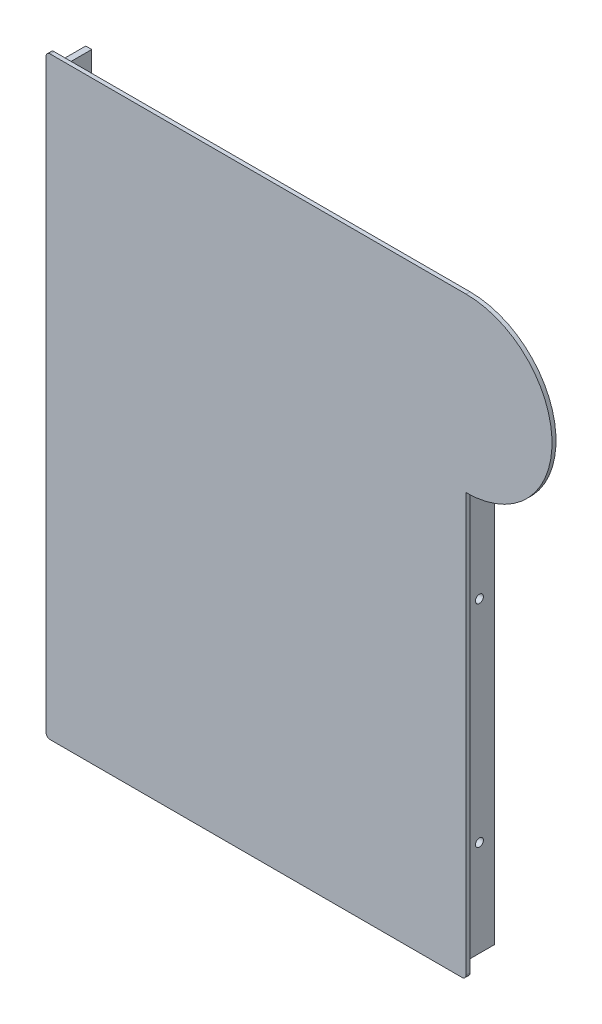
ISO-10303-21;
HEADER;
FILE_DESCRIPTION(('STEP AP214'),'2;1');
FILE_NAME('part.step','',(''),(''),'','','');
FILE_SCHEMA(('AUTOMOTIVE_DESIGN { 1 0 10303 214 1 1 1 1 }'));
ENDSEC;
DATA;
#1=APPLICATION_CONTEXT('core data for automotive mechanical design processes');
#2=APPLICATION_PROTOCOL_DEFINITION('international standard','automotive_design',2000,#1);
#3=PRODUCT_CONTEXT('',#1,'mechanical');
#4=PRODUCT('Part','Part','',(#3));
#5=PRODUCT_RELATED_PRODUCT_CATEGORY('part','',(#4));
#6=PRODUCT_DEFINITION_FORMATION('','',#4);
#7=PRODUCT_DEFINITION_CONTEXT('part definition',#1,'design');
#8=PRODUCT_DEFINITION('design','',#6,#7);
#9=PRODUCT_DEFINITION_SHAPE('','',#8);
#10=(LENGTH_UNIT() NAMED_UNIT(*) SI_UNIT(.MILLI.,.METRE.));
#11=(NAMED_UNIT(*) PLANE_ANGLE_UNIT() SI_UNIT($,.RADIAN.));
#12=(NAMED_UNIT(*) SI_UNIT($,.STERADIAN.) SOLID_ANGLE_UNIT());
#13=UNCERTAINTY_MEASURE_WITH_UNIT(LENGTH_MEASURE(1.E-05),#10,'distance_accuracy_value','');
#14=(GEOMETRIC_REPRESENTATION_CONTEXT(3) GLOBAL_UNCERTAINTY_ASSIGNED_CONTEXT((#13)) GLOBAL_UNIT_ASSIGNED_CONTEXT((#10,
#11,#12)) REPRESENTATION_CONTEXT('',''));
#15=CARTESIAN_POINT('',(0.,0.,0.));
#16=DIRECTION('',(0.,0.,1.));
#17=DIRECTION('',(1.,0.,0.));
#18=AXIS2_PLACEMENT_3D('',#15,#16,#17);
#19=CARTESIAN_POINT('',(0.,10.35,0.));
#20=DIRECTION('',(0.,0.,1.));
#21=DIRECTION('',(1.,0.,0.));
#22=AXIS2_PLACEMENT_3D('',#19,#20,#21);
#23=PLANE('',#22);
#24=CARTESIAN_POINT('',(0.,10.35,0.));
#25=DIRECTION('',(0.,0.,1.));
#26=DIRECTION('',(1.,0.,0.));
#27=AXIS2_PLACEMENT_3D('',#24,#25,#26);
#28=CIRCLE('',#27,43.);
#29=CARTESIAN_POINT('',(0.,-32.65,0.));
#30=VERTEX_POINT('',#29);
#31=CARTESIAN_POINT('',(0.,53.35,0.));
#32=VERTEX_POINT('',#31);
#33=EDGE_CURVE('E191',#30,#32,#28,.T.);
#34=ORIENTED_EDGE('',*,*,#33,.F.);
#35=DIRECTION('',(0.,1.,0.));
#36=VECTOR('',#35,1.);
#37=CARTESIAN_POINT('',(0.,-241.65,0.));
#38=LINE('',#37,#36);
#39=CARTESIAN_POINT('',(0.,-241.65,0.));
#40=VERTEX_POINT('',#39);
#41=EDGE_CURVE('E281',#40,#30,#38,.T.);
#42=ORIENTED_EDGE('',*,*,#41,.F.);
#43=CARTESIAN_POINT('',(-2.00000000000004,-241.65,0.));
#44=DIRECTION('',(0.,0.,1.));
#45=DIRECTION('',(1.,0.,0.));
#46=AXIS2_PLACEMENT_3D('',#43,#44,#45);
#47=CIRCLE('',#46,2.);
#48=CARTESIAN_POINT('',(-2.00000000000004,-243.65,0.));
#49=VERTEX_POINT('',#48);
#50=EDGE_CURVE('E308',#49,#40,#47,.T.);
#51=ORIENTED_EDGE('',*,*,#50,.F.);
#52=DIRECTION('',(1.,0.,0.));
#53=VECTOR('',#52,1.);
#54=CARTESIAN_POINT('',(-208.,-243.65,0.));
#55=LINE('',#54,#53);
#56=CARTESIAN_POINT('',(-208.,-243.65,0.));
#57=VERTEX_POINT('',#56);
#58=EDGE_CURVE('E306',#57,#49,#55,.T.);
#59=ORIENTED_EDGE('',*,*,#58,.F.);
#60=CARTESIAN_POINT('',(-208.,-241.65,0.));
#61=DIRECTION('',(0.,0.,1.));
#62=DIRECTION('',(1.,0.,0.));
#63=AXIS2_PLACEMENT_3D('',#60,#61,#62);
#64=CIRCLE('',#63,2.);
#65=CARTESIAN_POINT('',(-210.,-241.65,0.));
#66=VERTEX_POINT('',#65);
#67=EDGE_CURVE('E304',#66,#57,#64,.T.);
#68=ORIENTED_EDGE('',*,*,#67,.F.);
#69=DIRECTION('',(0.,-1.,0.));
#70=VECTOR('',#69,1.);
#71=CARTESIAN_POINT('',(-210.,51.35,0.));
#72=LINE('',#71,#70);
#73=CARTESIAN_POINT('',(-210.,51.35,0.));
#74=VERTEX_POINT('',#73);
#75=EDGE_CURVE('E302',#74,#66,#72,.T.);
#76=ORIENTED_EDGE('',*,*,#75,.F.);
#77=CARTESIAN_POINT('',(-208.,51.35,0.));
#78=DIRECTION('',(0.,0.,1.));
#79=DIRECTION('',(1.,0.,0.));
#80=AXIS2_PLACEMENT_3D('',#77,#78,#79);
#81=CIRCLE('',#80,2.);
#82=CARTESIAN_POINT('',(-208.,53.35,0.));
#83=VERTEX_POINT('',#82);
#84=EDGE_CURVE('E300',#83,#74,#81,.T.);
#85=ORIENTED_EDGE('',*,*,#84,.F.);
#86=DIRECTION('',(-1.,0.,0.));
#87=VECTOR('',#86,1.);
#88=CARTESIAN_POINT('',(0.,53.35,0.));
#89=LINE('',#88,#87);
#90=EDGE_CURVE('E298',#32,#83,#89,.T.);
#91=ORIENTED_EDGE('',*,*,#90,.F.);
#92=EDGE_LOOP('',(#34,#42,#51,#59,#68,#76,#85,#91));
#93=FACE_BOUND('',#92,.T.);
#94=DIRECTION('',(0.,1.,0.));
#95=VECTOR('',#94,1.);
#96=CARTESIAN_POINT('',(-5.80000000000004,-238.359531245036,0.));
#97=LINE('',#96,#95);
#98=CARTESIAN_POINT('',(-5.80000000000004,-236.986839537341,0.));
#99=VERTEX_POINT('',#98);
#100=CARTESIAN_POINT('',(-5.80000000000004,-37.127932811719,0.));
#101=VERTEX_POINT('',#100);
#102=EDGE_CURVE('E189',#99,#101,#97,.T.);
#103=ORIENTED_EDGE('',*,*,#102,.F.);
#104=DIRECTION('',(0.756701255018241,0.653760820678189,0.));
#105=VECTOR('',#104,1.);
#106=CARTESIAN_POINT('',(-7.64389759108179,-238.579896234945,0.));
#107=LINE('',#106,#105);
#108=CARTESIAN_POINT('',(-6.79907272616674,-237.85,0.));
#109=VERTEX_POINT('',#108);
#110=EDGE_CURVE('E184',#109,#99,#107,.T.);
#111=ORIENTED_EDGE('',*,*,#110,.F.);
#112=DIRECTION('',(1.,0.,0.));
#113=VECTOR('',#112,1.);
#114=CARTESIAN_POINT('',(-205.130446753057,-237.85,0.));
#115=LINE('',#114,#113);
#116=CARTESIAN_POINT('',(-203.757755045363,-237.85,0.));
#117=VERTEX_POINT('',#116);
#118=EDGE_CURVE('E243',#117,#109,#115,.T.);
#119=ORIENTED_EDGE('',*,*,#118,.F.);
#120=DIRECTION('',(0.65376082067819,-0.75670125501824,0.));
#121=VECTOR('',#120,1.);
#122=CARTESIAN_POINT('',(-204.929896234945,-236.493294793506,0.));
#123=LINE('',#122,#121);
#124=CARTESIAN_POINT('',(-204.2,-237.338119658421,0.));
#125=VERTEX_POINT('',#124);
#126=EDGE_CURVE('E240',#125,#117,#123,.T.);
#127=ORIENTED_EDGE('',*,*,#126,.F.);
#128=DIRECTION('',(0.,1.,0.));
#129=VECTOR('',#128,1.);
#130=CARTESIAN_POINT('',(-204.2,48.6876579472402,0.));
#131=LINE('',#130,#129);
#132=CARTESIAN_POINT('',(-204.2,48.6876579472402,0.));
#133=VERTEX_POINT('',#132);
#134=EDGE_CURVE('E237',#133,#125,#131,.F.);
#135=ORIENTED_EDGE('',*,*,#134,.F.);
#136=DIRECTION('',(-1.,0.,0.));
#137=VECTOR('',#136,1.);
#138=CARTESIAN_POINT('',(-204.2,48.6876579472402,0.));
#139=LINE('',#138,#137);
#140=CARTESIAN_POINT('',(-207.2,48.6876579472402,0.));
#141=VERTEX_POINT('',#140);
#142=EDGE_CURVE('E235',#133,#141,#139,.T.);
#143=ORIENTED_EDGE('',*,*,#142,.T.);
#144=DIRECTION('',(0.,-1.,0.));
#145=VECTOR('',#144,1.);
#146=CARTESIAN_POINT('',(-207.2,48.6876579472402,0.));
#147=LINE('',#146,#145);
#148=CARTESIAN_POINT('',(-207.2,-238.454577255541,0.));
#149=VERTEX_POINT('',#148);
#150=EDGE_CURVE('E233',#141,#149,#147,.T.);
#151=ORIENTED_EDGE('',*,*,#150,.T.);
#152=DIRECTION('',(0.65376082067819,-0.75670125501824,0.));
#153=VECTOR('',#152,1.);
#154=CARTESIAN_POINT('',(-207.2,-238.454577255541,0.));
#155=LINE('',#154,#153);
#156=CARTESIAN_POINT('',(-205.130446753057,-240.85,0.));
#157=VERTEX_POINT('',#156);
#158=EDGE_CURVE('E231',#149,#157,#155,.T.);
#159=ORIENTED_EDGE('',*,*,#158,.T.);
#160=DIRECTION('',(1.,0.,0.));
#161=VECTOR('',#160,1.);
#162=CARTESIAN_POINT('',(-205.130446753057,-240.85,0.));
#163=LINE('',#162,#161);
#164=CARTESIAN_POINT('',(-5.68261512904722,-240.85,0.));
#165=VERTEX_POINT('',#164);
#166=EDGE_CURVE('E229',#157,#165,#163,.T.);
#167=ORIENTED_EDGE('',*,*,#166,.T.);
#168=DIRECTION('',(0.756701255018241,0.653760820678189,0.));
#169=VECTOR('',#168,1.);
#170=CARTESIAN_POINT('',(-5.68261512904722,-240.85,0.));
#171=LINE('',#170,#169);
#172=CARTESIAN_POINT('',(-2.80000000000004,-238.359531245036,0.));
#173=VERTEX_POINT('',#172);
#174=EDGE_CURVE('E227',#165,#173,#171,.T.);
#175=ORIENTED_EDGE('',*,*,#174,.T.);
#176=DIRECTION('',(0.,1.,0.));
#177=VECTOR('',#176,1.);
#178=CARTESIAN_POINT('',(-2.80000000000004,-238.359531245036,0.));
#179=LINE('',#178,#177);
#180=CARTESIAN_POINT('',(-2.80000000000004,-37.127932811719,0.));
#181=VERTEX_POINT('',#180);
#182=EDGE_CURVE('E56',#173,#181,#179,.T.);
#183=ORIENTED_EDGE('',*,*,#182,.T.);
#184=DIRECTION('',(-1.,0.,0.));
#185=VECTOR('',#184,1.);
#186=CARTESIAN_POINT('',(-2.80000000000004,-37.127932811719,0.));
#187=LINE('',#186,#185);
#188=EDGE_CURVE('E51',#181,#101,#187,.T.);
#189=ORIENTED_EDGE('',*,*,#188,.T.);
#190=EDGE_LOOP('',(#103,#111,#119,#127,#135,#143,#151,#159,#167,#175,#183,#189));
#191=FACE_BOUND('',#190,.T.);
#192=ADVANCED_FACE('F34',(#93,#191),#23,.F.);
#193=CARTESIAN_POINT('',(0.,10.35,2.));
#194=DIRECTION('',(0.,0.,-1.));
#195=DIRECTION('',(-1.,0.,0.));
#196=AXIS2_PLACEMENT_3D('',#193,#194,#195);
#197=CYLINDRICAL_SURFACE('',#196,43.);
#198=ORIENTED_EDGE('',*,*,#33,.T.);
#199=DIRECTION('',(0.,0.,-1.));
#200=VECTOR('',#199,1.);
#201=CARTESIAN_POINT('',(0.,53.35,2.));
#202=LINE('',#201,#200);
#203=CARTESIAN_POINT('',(0.,53.35,2.));
#204=VERTEX_POINT('',#203);
#205=EDGE_CURVE('E11',#204,#32,#202,.T.);
#206=ORIENTED_EDGE('',*,*,#205,.F.);
#207=CARTESIAN_POINT('',(0.,10.35,2.));
#208=DIRECTION('',(0.,0.,1.));
#209=DIRECTION('',(1.,0.,0.));
#210=AXIS2_PLACEMENT_3D('',#207,#208,#209);
#211=CIRCLE('',#210,43.);
#212=CARTESIAN_POINT('',(0.,-32.65,2.));
#213=VERTEX_POINT('',#212);
#214=EDGE_CURVE('E277',#213,#204,#211,.T.);
#215=ORIENTED_EDGE('',*,*,#214,.F.);
#216=DIRECTION('',(0.,0.,-1.));
#217=VECTOR('',#216,1.);
#218=CARTESIAN_POINT('',(0.,-32.65,2.));
#219=LINE('',#218,#217);
#220=EDGE_CURVE('E295',#213,#30,#219,.T.);
#221=ORIENTED_EDGE('',*,*,#220,.T.);
#222=EDGE_LOOP('',(#198,#206,#215,#221));
#223=FACE_BOUND('',#222,.T.);
#224=ADVANCED_FACE('F36',(#223),#197,.T.);
#225=CARTESIAN_POINT('',(0.,53.35,2.));
#226=DIRECTION('',(0.,-1.,0.));
#227=DIRECTION('',(0.,0.,-1.));
#228=AXIS2_PLACEMENT_3D('',#225,#226,#227);
#229=PLANE('',#228);
#230=ORIENTED_EDGE('',*,*,#90,.T.);
#231=DIRECTION('',(0.,0.,-1.));
#232=VECTOR('',#231,1.);
#233=CARTESIAN_POINT('',(-208.,53.35,2.));
#234=LINE('',#233,#232);
#235=CARTESIAN_POINT('',(-208.,53.35,2.));
#236=VERTEX_POINT('',#235);
#237=EDGE_CURVE('E43',#236,#83,#234,.T.);
#238=ORIENTED_EDGE('',*,*,#237,.F.);
#239=DIRECTION('',(-1.,0.,0.));
#240=VECTOR('',#239,1.);
#241=CARTESIAN_POINT('',(0.,53.35,2.));
#242=LINE('',#241,#240);
#243=EDGE_CURVE('E280',#204,#236,#242,.T.);
#244=ORIENTED_EDGE('',*,*,#243,.F.);
#245=ORIENTED_EDGE('',*,*,#205,.T.);
#246=EDGE_LOOP('',(#230,#238,#244,#245));
#247=FACE_BOUND('',#246,.T.);
#248=ADVANCED_FACE('F415',(#247),#229,.F.);
#249=CARTESIAN_POINT('',(-208.,51.35,2.));
#250=DIRECTION('',(0.,0.,-1.));
#251=DIRECTION('',(-1.,0.,0.));
#252=AXIS2_PLACEMENT_3D('',#249,#250,#251);
#253=CYLINDRICAL_SURFACE('',#252,2.);
#254=ORIENTED_EDGE('',*,*,#84,.T.);
#255=DIRECTION('',(0.,0.,-1.));
#256=VECTOR('',#255,1.);
#257=CARTESIAN_POINT('',(-210.,51.35,2.));
#258=LINE('',#257,#256);
#259=CARTESIAN_POINT('',(-210.,51.35,2.));
#260=VERTEX_POINT('',#259);
#261=EDGE_CURVE('E325',#260,#74,#258,.T.);
#262=ORIENTED_EDGE('',*,*,#261,.F.);
#263=CARTESIAN_POINT('',(-208.,51.35,2.));
#264=DIRECTION('',(0.,0.,1.));
#265=DIRECTION('',(1.,0.,0.));
#266=AXIS2_PLACEMENT_3D('',#263,#264,#265);
#267=CIRCLE('',#266,2.);
#268=EDGE_CURVE('E283',#236,#260,#267,.T.);
#269=ORIENTED_EDGE('',*,*,#268,.F.);
#270=ORIENTED_EDGE('',*,*,#237,.T.);
#271=EDGE_LOOP('',(#254,#262,#269,#270));
#272=FACE_BOUND('',#271,.T.);
#273=ADVANCED_FACE('F441',(#272),#253,.T.);
#274=CARTESIAN_POINT('',(-210.,51.35,2.));
#275=DIRECTION('',(1.,0.,0.));
#276=DIRECTION('',(0.,1.,0.));
#277=AXIS2_PLACEMENT_3D('',#274,#275,#276);
#278=PLANE('',#277);
#279=ORIENTED_EDGE('',*,*,#75,.T.);
#280=DIRECTION('',(0.,0.,-1.));
#281=VECTOR('',#280,1.);
#282=CARTESIAN_POINT('',(-210.,-241.65,2.));
#283=LINE('',#282,#281);
#284=CARTESIAN_POINT('',(-210.,-241.65,2.));
#285=VERTEX_POINT('',#284);
#286=EDGE_CURVE('E322',#285,#66,#283,.T.);
#287=ORIENTED_EDGE('',*,*,#286,.F.);
#288=DIRECTION('',(0.,-1.,0.));
#289=VECTOR('',#288,1.);
#290=CARTESIAN_POINT('',(-210.,51.35,2.));
#291=LINE('',#290,#289);
#292=EDGE_CURVE('E285',#260,#285,#291,.T.);
#293=ORIENTED_EDGE('',*,*,#292,.F.);
#294=ORIENTED_EDGE('',*,*,#261,.T.);
#295=EDGE_LOOP('',(#279,#287,#293,#294));
#296=FACE_BOUND('',#295,.T.);
#297=ADVANCED_FACE('F437',(#296),#278,.F.);
#298=CARTESIAN_POINT('',(-208.,-241.65,2.));
#299=DIRECTION('',(0.,0.,-1.));
#300=DIRECTION('',(-1.,0.,0.));
#301=AXIS2_PLACEMENT_3D('',#298,#299,#300);
#302=CYLINDRICAL_SURFACE('',#301,2.);
#303=ORIENTED_EDGE('',*,*,#67,.T.);
#304=DIRECTION('',(0.,0.,-1.));
#305=VECTOR('',#304,1.);
#306=CARTESIAN_POINT('',(-208.,-243.65,2.));
#307=LINE('',#306,#305);
#308=CARTESIAN_POINT('',(-208.,-243.65,2.));
#309=VERTEX_POINT('',#308);
#310=EDGE_CURVE('E319',#309,#57,#307,.T.);
#311=ORIENTED_EDGE('',*,*,#310,.F.);
#312=CARTESIAN_POINT('',(-208.,-241.65,2.));
#313=DIRECTION('',(0.,0.,1.));
#314=DIRECTION('',(1.,0.,0.));
#315=AXIS2_PLACEMENT_3D('',#312,#313,#314);
#316=CIRCLE('',#315,2.);
#317=EDGE_CURVE('E287',#285,#309,#316,.T.);
#318=ORIENTED_EDGE('',*,*,#317,.F.);
#319=ORIENTED_EDGE('',*,*,#286,.T.);
#320=EDGE_LOOP('',(#303,#311,#318,#319));
#321=FACE_BOUND('',#320,.T.);
#322=ADVANCED_FACE('F433',(#321),#302,.T.);
#323=CARTESIAN_POINT('',(-208.,-243.65,2.));
#324=DIRECTION('',(0.,1.,0.));
#325=DIRECTION('',(0.,0.,1.));
#326=AXIS2_PLACEMENT_3D('',#323,#324,#325);
#327=PLANE('',#326);
#328=ORIENTED_EDGE('',*,*,#58,.T.);
#329=DIRECTION('',(0.,0.,-1.));
#330=VECTOR('',#329,1.);
#331=CARTESIAN_POINT('',(-2.00000000000004,-243.65,2.));
#332=LINE('',#331,#330);
#333=CARTESIAN_POINT('',(-2.00000000000004,-243.65,2.));
#334=VERTEX_POINT('',#333);
#335=EDGE_CURVE('E316',#334,#49,#332,.T.);
#336=ORIENTED_EDGE('',*,*,#335,.F.);
#337=DIRECTION('',(1.,0.,0.));
#338=VECTOR('',#337,1.);
#339=CARTESIAN_POINT('',(-208.,-243.65,2.));
#340=LINE('',#339,#338);
#341=EDGE_CURVE('E289',#309,#334,#340,.T.);
#342=ORIENTED_EDGE('',*,*,#341,.F.);
#343=ORIENTED_EDGE('',*,*,#310,.T.);
#344=EDGE_LOOP('',(#328,#336,#342,#343));
#345=FACE_BOUND('',#344,.T.);
#346=ADVANCED_FACE('F429',(#345),#327,.F.);
#347=CARTESIAN_POINT('',(-2.00000000000004,-241.65,2.));
#348=DIRECTION('',(0.,0.,-1.));
#349=DIRECTION('',(-1.,0.,0.));
#350=AXIS2_PLACEMENT_3D('',#347,#348,#349);
#351=CYLINDRICAL_SURFACE('',#350,2.);
#352=ORIENTED_EDGE('',*,*,#50,.T.);
#353=DIRECTION('',(0.,0.,-1.));
#354=VECTOR('',#353,1.);
#355=CARTESIAN_POINT('',(0.,-241.65,2.));
#356=LINE('',#355,#354);
#357=CARTESIAN_POINT('',(0.,-241.65,2.));
#358=VERTEX_POINT('',#357);
#359=EDGE_CURVE('E313',#358,#40,#356,.T.);
#360=ORIENTED_EDGE('',*,*,#359,.F.);
#361=CARTESIAN_POINT('',(-2.00000000000004,-241.65,2.));
#362=DIRECTION('',(0.,0.,1.));
#363=DIRECTION('',(1.,0.,0.));
#364=AXIS2_PLACEMENT_3D('',#361,#362,#363);
#365=CIRCLE('',#364,2.);
#366=EDGE_CURVE('E291',#334,#358,#365,.T.);
#367=ORIENTED_EDGE('',*,*,#366,.F.);
#368=ORIENTED_EDGE('',*,*,#335,.T.);
#369=EDGE_LOOP('',(#352,#360,#367,#368));
#370=FACE_BOUND('',#369,.T.);
#371=ADVANCED_FACE('F425',(#370),#351,.T.);
#372=CARTESIAN_POINT('',(0.,-241.65,2.));
#373=DIRECTION('',(-1.,0.,0.));
#374=DIRECTION('',(0.,-1.,0.));
#375=AXIS2_PLACEMENT_3D('',#372,#373,#374);
#376=PLANE('',#375);
#377=ORIENTED_EDGE('',*,*,#41,.T.);
#378=ORIENTED_EDGE('',*,*,#220,.F.);
#379=DIRECTION('',(0.,1.,0.));
#380=VECTOR('',#379,1.);
#381=CARTESIAN_POINT('',(0.,-241.65,2.));
#382=LINE('',#381,#380);
#383=EDGE_CURVE('E293',#358,#213,#382,.T.);
#384=ORIENTED_EDGE('',*,*,#383,.F.);
#385=ORIENTED_EDGE('',*,*,#359,.T.);
#386=EDGE_LOOP('',(#377,#378,#384,#385));
#387=FACE_BOUND('',#386,.T.);
#388=ADVANCED_FACE('F422',(#387),#376,.F.);
#389=CARTESIAN_POINT('',(0.,10.35,2.));
#390=DIRECTION('',(0.,0.,1.));
#391=DIRECTION('',(1.,0.,0.));
#392=AXIS2_PLACEMENT_3D('',#389,#390,#391);
#393=PLANE('',#392);
#394=ORIENTED_EDGE('',*,*,#214,.T.);
#395=ORIENTED_EDGE('',*,*,#243,.T.);
#396=ORIENTED_EDGE('',*,*,#268,.T.);
#397=ORIENTED_EDGE('',*,*,#292,.T.);
#398=ORIENTED_EDGE('',*,*,#317,.T.);
#399=ORIENTED_EDGE('',*,*,#341,.T.);
#400=ORIENTED_EDGE('',*,*,#366,.T.);
#401=ORIENTED_EDGE('',*,*,#383,.T.);
#402=EDGE_LOOP('',(#394,#395,#396,#397,#398,#399,#400,#401));
#403=FACE_BOUND('',#402,.T.);
#404=ADVANCED_FACE('F420',(#403),#393,.T.);
#405=CARTESIAN_POINT('',(-5.80000000000004,-238.359531245036,-15.));
#406=DIRECTION('',(1.,0.,0.));
#407=DIRECTION('',(0.,0.,-1.));
#408=AXIS2_PLACEMENT_3D('',#405,#406,#407);
#409=PLANE('',#408);
#410=CARTESIAN_POINT('',(-5.80000000000004,-84.8010569567936,-7.5));
#411=DIRECTION('',(1.,0.,0.));
#412=DIRECTION('',(0.,0.,-1.));
#413=AXIS2_PLACEMENT_3D('',#410,#411,#412);
#414=CIRCLE('',#413,2.00000000000001);
#415=CARTESIAN_POINT('',(-5.80000000000004,-84.8010569567936,-9.50000000000001));
#416=VERTEX_POINT('',#415);
#417=EDGE_CURVE('E346',#416,#416,#414,.T.);
#418=ORIENTED_EDGE('',*,*,#417,.T.);
#419=EDGE_LOOP('',(#418));
#420=FACE_BOUND('',#419,.T.);
#421=CARTESIAN_POINT('',(-5.80000000000004,-190.350496004111,-7.5));
#422=DIRECTION('',(1.,0.,0.));
#423=DIRECTION('',(0.,0.,-1.));
#424=AXIS2_PLACEMENT_3D('',#421,#422,#423);
#425=CIRCLE('',#424,2.00000000000001);
#426=CARTESIAN_POINT('',(-5.80000000000004,-190.350496004111,-9.50000000000001));
#427=VERTEX_POINT('',#426);
#428=EDGE_CURVE('E343',#427,#427,#425,.T.);
#429=ORIENTED_EDGE('',*,*,#428,.T.);
#430=EDGE_LOOP('',(#429));
#431=FACE_BOUND('',#430,.T.);
#432=ORIENTED_EDGE('',*,*,#102,.T.);
#433=DIRECTION('',(0.,0.,1.));
#434=VECTOR('',#433,1.);
#435=CARTESIAN_POINT('',(-5.80000000000004,-37.127932811719,-15.));
#436=LINE('',#435,#434);
#437=CARTESIAN_POINT('',(-5.80000000000004,-37.127932811719,-15.));
#438=VERTEX_POINT('',#437);
#439=EDGE_CURVE('E187',#438,#101,#436,.T.);
#440=ORIENTED_EDGE('',*,*,#439,.F.);
#441=DIRECTION('',(0.,1.,0.));
#442=VECTOR('',#441,1.);
#443=CARTESIAN_POINT('',(-5.80000000000004,-238.359531245036,-15.));
#444=LINE('',#443,#442);
#445=CARTESIAN_POINT('',(-5.80000000000004,-236.986839537341,-15.));
#446=VERTEX_POINT('',#445);
#447=EDGE_CURVE('E172',#446,#438,#444,.T.);
#448=ORIENTED_EDGE('',*,*,#447,.F.);
#449=DIRECTION('',(0.,0.,1.));
#450=VECTOR('',#449,1.);
#451=CARTESIAN_POINT('',(-5.80000000000004,-236.986839537341,-15.));
#452=LINE('',#451,#450);
#453=EDGE_CURVE('E222',#446,#99,#452,.T.);
#454=ORIENTED_EDGE('',*,*,#453,.T.);
#455=EDGE_LOOP('',(#432,#440,#448,#454));
#456=FACE_BOUND('',#455,.T.);
#457=ADVANCED_FACE('F188',(#420,#431,#456),#409,.F.);
#458=CARTESIAN_POINT('',(-2.80000000000004,-37.127932811719,-15.));
#459=DIRECTION('',(0.,1.,0.));
#460=DIRECTION('',(-1.,0.,0.));
#461=AXIS2_PLACEMENT_3D('',#458,#459,#460);
#462=PLANE('',#461);
#463=ORIENTED_EDGE('',*,*,#188,.F.);
#464=DIRECTION('',(0.,0.,1.));
#465=VECTOR('',#464,1.);
#466=CARTESIAN_POINT('',(-2.80000000000004,-37.127932811719,-15.));
#467=LINE('',#466,#465);
#468=CARTESIAN_POINT('',(-2.80000000000004,-37.127932811719,-15.));
#469=VERTEX_POINT('',#468);
#470=EDGE_CURVE('E192',#469,#181,#467,.T.);
#471=ORIENTED_EDGE('',*,*,#470,.F.);
#472=DIRECTION('',(-1.,0.,0.));
#473=VECTOR('',#472,1.);
#474=CARTESIAN_POINT('',(-2.80000000000004,-37.127932811719,-15.));
#475=LINE('',#474,#473);
#476=EDGE_CURVE('E177',#469,#438,#475,.T.);
#477=ORIENTED_EDGE('',*,*,#476,.T.);
#478=ORIENTED_EDGE('',*,*,#439,.T.);
#479=EDGE_LOOP('',(#463,#471,#477,#478));
#480=FACE_BOUND('',#479,.T.);
#481=ADVANCED_FACE('F194',(#480),#462,.T.);
#482=CARTESIAN_POINT('',(-2.80000000000004,-238.359531245036,-15.));
#483=DIRECTION('',(1.,0.,0.));
#484=DIRECTION('',(0.,0.,-1.));
#485=AXIS2_PLACEMENT_3D('',#482,#483,#484);
#486=PLANE('',#485);
#487=CARTESIAN_POINT('',(-2.80000000000004,-84.8010569567936,-7.5));
#488=DIRECTION('',(1.,0.,0.));
#489=DIRECTION('',(0.,0.,-1.));
#490=AXIS2_PLACEMENT_3D('',#487,#488,#489);
#491=CIRCLE('',#490,2.00000000000001);
#492=CARTESIAN_POINT('',(-2.80000000000004,-84.8010569567936,-9.50000000000001));
#493=VERTEX_POINT('',#492);
#494=EDGE_CURVE('E351',#493,#493,#491,.T.);
#495=ORIENTED_EDGE('',*,*,#494,.F.);
#496=EDGE_LOOP('',(#495));
#497=FACE_BOUND('',#496,.T.);
#498=CARTESIAN_POINT('',(-2.80000000000004,-190.350496004111,-7.5));
#499=DIRECTION('',(1.,0.,0.));
#500=DIRECTION('',(0.,0.,-1.));
#501=AXIS2_PLACEMENT_3D('',#498,#499,#500);
#502=CIRCLE('',#501,2.00000000000001);
#503=CARTESIAN_POINT('',(-2.80000000000004,-190.350496004111,-9.50000000000001));
#504=VERTEX_POINT('',#503);
#505=EDGE_CURVE('E338',#504,#504,#502,.T.);
#506=ORIENTED_EDGE('',*,*,#505,.F.);
#507=EDGE_LOOP('',(#506));
#508=FACE_BOUND('',#507,.T.);
#509=ORIENTED_EDGE('',*,*,#182,.F.);
#510=DIRECTION('',(0.,0.,1.));
#511=VECTOR('',#510,1.);
#512=CARTESIAN_POINT('',(-2.80000000000004,-238.359531245036,-15.));
#513=LINE('',#512,#511);
#514=CARTESIAN_POINT('',(-2.80000000000004,-238.359531245036,-15.));
#515=VERTEX_POINT('',#514);
#516=EDGE_CURVE('E273',#515,#173,#513,.T.);
#517=ORIENTED_EDGE('',*,*,#516,.F.);
#518=DIRECTION('',(0.,1.,0.));
#519=VECTOR('',#518,1.);
#520=CARTESIAN_POINT('',(-2.80000000000004,-238.359531245036,-15.));
#521=LINE('',#520,#519);
#522=EDGE_CURVE('E195',#515,#469,#521,.T.);
#523=ORIENTED_EDGE('',*,*,#522,.T.);
#524=ORIENTED_EDGE('',*,*,#470,.T.);
#525=EDGE_LOOP('',(#509,#517,#523,#524));
#526=FACE_BOUND('',#525,.T.);
#527=ADVANCED_FACE('F479',(#497,#508,#526),#486,.T.);
#528=CARTESIAN_POINT('',(-5.68261512904722,-240.85,-15.));
#529=DIRECTION('',(0.653760820678189,-0.756701255018241,0.));
#530=DIRECTION('',(0.756701255018241,0.653760820678189,0.));
#531=AXIS2_PLACEMENT_3D('',#528,#529,#530);
#532=PLANE('',#531);
#533=ORIENTED_EDGE('',*,*,#174,.F.);
#534=DIRECTION('',(0.,0.,1.));
#535=VECTOR('',#534,1.);
#536=CARTESIAN_POINT('',(-5.68261512904722,-240.85,-15.));
#537=LINE('',#536,#535);
#538=CARTESIAN_POINT('',(-5.68261512904722,-240.85,-15.));
#539=VERTEX_POINT('',#538);
#540=EDGE_CURVE('E270',#539,#165,#537,.T.);
#541=ORIENTED_EDGE('',*,*,#540,.F.);
#542=DIRECTION('',(0.756701255018241,0.653760820678189,0.));
#543=VECTOR('',#542,1.);
#544=CARTESIAN_POINT('',(-5.68261512904722,-240.85,-15.));
#545=LINE('',#544,#543);
#546=EDGE_CURVE('E197',#539,#515,#545,.T.);
#547=ORIENTED_EDGE('',*,*,#546,.T.);
#548=ORIENTED_EDGE('',*,*,#516,.T.);
#549=EDGE_LOOP('',(#533,#541,#547,#548));
#550=FACE_BOUND('',#549,.T.);
#551=ADVANCED_FACE('F368',(#550),#532,.T.);
#552=CARTESIAN_POINT('',(-205.130446753057,-240.85,-15.));
#553=DIRECTION('',(0.,-1.,0.));
#554=DIRECTION('',(1.,0.,0.));
#555=AXIS2_PLACEMENT_3D('',#552,#553,#554);
#556=PLANE('',#555);
#557=CARTESIAN_POINT('',(-42.1921113491282,-240.85,-7.5));
#558=DIRECTION('',(0.,-1.,0.));
#559=DIRECTION('',(-1.,0.,0.));
#560=AXIS2_PLACEMENT_3D('',#557,#558,#559);
#561=CIRCLE('',#560,2.);
#562=CARTESIAN_POINT('',(-44.1921113491282,-240.85,-7.5));
#563=VERTEX_POINT('',#562);
#564=EDGE_CURVE('E335',#563,#563,#561,.T.);
#565=ORIENTED_EDGE('',*,*,#564,.F.);
#566=EDGE_LOOP('',(#565));
#567=FACE_BOUND('',#566,.T.);
#568=CARTESIAN_POINT('',(-167.807888650872,-240.85,-7.5));
#569=DIRECTION('',(0.,-1.,0.));
#570=DIRECTION('',(1.,0.,0.));
#571=AXIS2_PLACEMENT_3D('',#568,#569,#570);
#572=CIRCLE('',#571,2.);
#573=CARTESIAN_POINT('',(-165.807888650872,-240.85,-7.5));
#574=VERTEX_POINT('',#573);
#575=EDGE_CURVE('E332',#574,#574,#572,.T.);
#576=ORIENTED_EDGE('',*,*,#575,.F.);
#577=EDGE_LOOP('',(#576));
#578=FACE_BOUND('',#577,.T.);
#579=ORIENTED_EDGE('',*,*,#166,.F.);
#580=DIRECTION('',(0.,0.,1.));
#581=VECTOR('',#580,1.);
#582=CARTESIAN_POINT('',(-205.130446753057,-240.85,-15.));
#583=LINE('',#582,#581);
#584=CARTESIAN_POINT('',(-205.130446753057,-240.85,-15.));
#585=VERTEX_POINT('',#584);
#586=EDGE_CURVE('E267',#585,#157,#583,.T.);
#587=ORIENTED_EDGE('',*,*,#586,.F.);
#588=DIRECTION('',(1.,0.,0.));
#589=VECTOR('',#588,1.);
#590=CARTESIAN_POINT('',(-205.130446753057,-240.85,-15.));
#591=LINE('',#590,#589);
#592=EDGE_CURVE('E203',#585,#539,#591,.T.);
#593=ORIENTED_EDGE('',*,*,#592,.T.);
#594=ORIENTED_EDGE('',*,*,#540,.T.);
#595=EDGE_LOOP('',(#579,#587,#593,#594));
#596=FACE_BOUND('',#595,.T.);
#597=ADVANCED_FACE('F364',(#567,#578,#596),#556,.T.);
#598=CARTESIAN_POINT('',(-207.2,-238.454577255541,-15.));
#599=DIRECTION('',(-0.75670125501824,-0.65376082067819,0.));
#600=DIRECTION('',(0.65376082067819,-0.75670125501824,0.));
#601=AXIS2_PLACEMENT_3D('',#598,#599,#600);
#602=PLANE('',#601);
#603=ORIENTED_EDGE('',*,*,#158,.F.);
#604=DIRECTION('',(0.,0.,1.));
#605=VECTOR('',#604,1.);
#606=CARTESIAN_POINT('',(-207.2,-238.454577255541,-15.));
#607=LINE('',#606,#605);
#608=CARTESIAN_POINT('',(-207.2,-238.454577255541,-15.));
#609=VERTEX_POINT('',#608);
#610=EDGE_CURVE('E264',#609,#149,#607,.T.);
#611=ORIENTED_EDGE('',*,*,#610,.F.);
#612=DIRECTION('',(0.65376082067819,-0.75670125501824,0.));
#613=VECTOR('',#612,1.);
#614=CARTESIAN_POINT('',(-207.2,-238.454577255541,-15.));
#615=LINE('',#614,#613);
#616=EDGE_CURVE('E206',#609,#585,#615,.T.);
#617=ORIENTED_EDGE('',*,*,#616,.T.);
#618=ORIENTED_EDGE('',*,*,#586,.T.);
#619=EDGE_LOOP('',(#603,#611,#617,#618));
#620=FACE_BOUND('',#619,.T.);
#621=ADVANCED_FACE('F367',(#620),#602,.T.);
#622=CARTESIAN_POINT('',(-207.2,48.6876579472402,-15.));
#623=DIRECTION('',(-1.,0.,0.));
#624=DIRECTION('',(0.,0.,1.));
#625=AXIS2_PLACEMENT_3D('',#622,#623,#624);
#626=PLANE('',#625);
#627=CARTESIAN_POINT('',(-207.2,-84.8010569567936,-7.5));
#628=DIRECTION('',(-1.,0.,0.));
#629=DIRECTION('',(0.,0.,-1.));
#630=AXIS2_PLACEMENT_3D('',#627,#628,#629);
#631=CIRCLE('',#630,2.00000000000001);
#632=CARTESIAN_POINT('',(-207.2,-84.8010569567936,-9.50000000000001));
#633=VERTEX_POINT('',#632);
#634=EDGE_CURVE('E604',#633,#633,#631,.T.);
#635=ORIENTED_EDGE('',*,*,#634,.F.);
#636=EDGE_LOOP('',(#635));
#637=FACE_BOUND('',#636,.T.);
#638=CARTESIAN_POINT('',(-207.2,-190.350496004111,-7.5));
#639=DIRECTION('',(-1.,0.,0.));
#640=DIRECTION('',(0.,0.,1.));
#641=AXIS2_PLACEMENT_3D('',#638,#639,#640);
#642=CIRCLE('',#641,2.00000000000001);
#643=CARTESIAN_POINT('',(-207.2,-190.350496004111,-5.49999999999999));
#644=VERTEX_POINT('',#643);
#645=EDGE_CURVE('E339',#644,#644,#642,.T.);
#646=ORIENTED_EDGE('',*,*,#645,.F.);
#647=EDGE_LOOP('',(#646));
#648=FACE_BOUND('',#647,.T.);
#649=ORIENTED_EDGE('',*,*,#150,.F.);
#650=DIRECTION('',(0.,0.,1.));
#651=VECTOR('',#650,1.);
#652=CARTESIAN_POINT('',(-207.2,48.6876579472402,-15.));
#653=LINE('',#652,#651);
#654=CARTESIAN_POINT('',(-207.2,48.6876579472402,-15.));
#655=VERTEX_POINT('',#654);
#656=EDGE_CURVE('E261',#655,#141,#653,.T.);
#657=ORIENTED_EDGE('',*,*,#656,.F.);
#658=DIRECTION('',(0.,-1.,0.));
#659=VECTOR('',#658,1.);
#660=CARTESIAN_POINT('',(-207.2,48.6876579472402,-15.));
#661=LINE('',#660,#659);
#662=EDGE_CURVE('E209',#655,#609,#661,.T.);
#663=ORIENTED_EDGE('',*,*,#662,.T.);
#664=ORIENTED_EDGE('',*,*,#610,.T.);
#665=EDGE_LOOP('',(#649,#657,#663,#664));
#666=FACE_BOUND('',#665,.T.);
#667=ADVANCED_FACE('F382',(#637,#648,#666),#626,.T.);
#668=CARTESIAN_POINT('',(-204.2,48.6876579472402,-15.));
#669=DIRECTION('',(0.,1.,0.));
#670=DIRECTION('',(0.,0.,1.));
#671=AXIS2_PLACEMENT_3D('',#668,#669,#670);
#672=PLANE('',#671);
#673=ORIENTED_EDGE('',*,*,#142,.F.);
#674=DIRECTION('',(0.,0.,1.));
#675=VECTOR('',#674,1.);
#676=CARTESIAN_POINT('',(-204.2,48.6876579472402,-15.));
#677=LINE('',#676,#675);
#678=CARTESIAN_POINT('',(-204.2,48.6876579472402,-15.));
#679=VERTEX_POINT('',#678);
#680=EDGE_CURVE('E258',#679,#133,#677,.T.);
#681=ORIENTED_EDGE('',*,*,#680,.F.);
#682=DIRECTION('',(-1.,0.,0.));
#683=VECTOR('',#682,1.);
#684=CARTESIAN_POINT('',(-204.2,48.6876579472402,-15.));
#685=LINE('',#684,#683);
#686=EDGE_CURVE('E212',#679,#655,#685,.T.);
#687=ORIENTED_EDGE('',*,*,#686,.T.);
#688=ORIENTED_EDGE('',*,*,#656,.T.);
#689=EDGE_LOOP('',(#673,#681,#687,#688));
#690=FACE_BOUND('',#689,.T.);
#691=ADVANCED_FACE('F385',(#690),#672,.T.);
#692=CARTESIAN_POINT('',(-204.2,48.6876579472402,-15.));
#693=DIRECTION('',(-1.,0.,0.));
#694=DIRECTION('',(0.,0.,1.));
#695=AXIS2_PLACEMENT_3D('',#692,#693,#694);
#696=PLANE('',#695);
#697=CARTESIAN_POINT('',(-204.2,-84.8010569567936,-7.5));
#698=DIRECTION('',(-1.,0.,0.));
#699=DIRECTION('',(0.,0.,1.));
#700=AXIS2_PLACEMENT_3D('',#697,#698,#699);
#701=CIRCLE('',#700,2.00000000000001);
#702=CARTESIAN_POINT('',(-204.2,-84.8010569567936,-5.49999999999999));
#703=VERTEX_POINT('',#702);
#704=EDGE_CURVE('E38',#703,#703,#701,.T.);
#705=ORIENTED_EDGE('',*,*,#704,.T.);
#706=EDGE_LOOP('',(#705));
#707=FACE_BOUND('',#706,.T.);
#708=CARTESIAN_POINT('',(-204.2,-190.350496004111,-7.5));
#709=DIRECTION('',(-1.,0.,0.));
#710=DIRECTION('',(0.,0.,1.));
#711=AXIS2_PLACEMENT_3D('',#708,#709,#710);
#712=CIRCLE('',#711,2.00000000000001);
#713=CARTESIAN_POINT('',(-204.2,-190.350496004111,-5.49999999999999));
#714=VERTEX_POINT('',#713);
#715=EDGE_CURVE('E336',#714,#714,#712,.T.);
#716=ORIENTED_EDGE('',*,*,#715,.T.);
#717=EDGE_LOOP('',(#716));
#718=FACE_BOUND('',#717,.T.);
#719=ORIENTED_EDGE('',*,*,#134,.T.);
#720=DIRECTION('',(0.,0.,1.));
#721=VECTOR('',#720,1.);
#722=CARTESIAN_POINT('',(-204.2,-237.338119658421,-15.));
#723=LINE('',#722,#721);
#724=CARTESIAN_POINT('',(-204.2,-237.338119658421,-15.));
#725=VERTEX_POINT('',#724);
#726=EDGE_CURVE('E255',#725,#125,#723,.T.);
#727=ORIENTED_EDGE('',*,*,#726,.F.);
#728=DIRECTION('',(0.,1.,0.));
#729=VECTOR('',#728,1.);
#730=CARTESIAN_POINT('',(-204.2,48.6876579472402,-15.));
#731=LINE('',#730,#729);
#732=EDGE_CURVE('E215',#679,#725,#731,.F.);
#733=ORIENTED_EDGE('',*,*,#732,.F.);
#734=ORIENTED_EDGE('',*,*,#680,.T.);
#735=EDGE_LOOP('',(#719,#727,#733,#734));
#736=FACE_BOUND('',#735,.T.);
#737=ADVANCED_FACE('F391',(#707,#718,#736),#696,.F.);
#738=CARTESIAN_POINT('',(-204.929896234945,-236.493294793506,-15.));
#739=DIRECTION('',(-0.75670125501824,-0.65376082067819,0.));
#740=DIRECTION('',(0.65376082067819,-0.75670125501824,0.));
#741=AXIS2_PLACEMENT_3D('',#738,#739,#740);
#742=PLANE('',#741);
#743=ORIENTED_EDGE('',*,*,#126,.T.);
#744=DIRECTION('',(0.,0.,1.));
#745=VECTOR('',#744,1.);
#746=CARTESIAN_POINT('',(-203.757755045363,-237.85,-15.));
#747=LINE('',#746,#745);
#748=CARTESIAN_POINT('',(-203.757755045363,-237.85,-15.));
#749=VERTEX_POINT('',#748);
#750=EDGE_CURVE('E252',#749,#117,#747,.T.);
#751=ORIENTED_EDGE('',*,*,#750,.F.);
#752=DIRECTION('',(0.65376082067819,-0.75670125501824,0.));
#753=VECTOR('',#752,1.);
#754=CARTESIAN_POINT('',(-204.929896234945,-236.493294793506,-15.));
#755=LINE('',#754,#753);
#756=EDGE_CURVE('E217',#725,#749,#755,.T.);
#757=ORIENTED_EDGE('',*,*,#756,.F.);
#758=ORIENTED_EDGE('',*,*,#726,.T.);
#759=EDGE_LOOP('',(#743,#751,#757,#758));
#760=FACE_BOUND('',#759,.T.);
#761=ADVANCED_FACE('F393',(#760),#742,.F.);
#762=CARTESIAN_POINT('',(-205.130446753057,-237.85,-15.));
#763=DIRECTION('',(0.,-1.,0.));
#764=DIRECTION('',(1.,0.,0.));
#765=AXIS2_PLACEMENT_3D('',#762,#763,#764);
#766=PLANE('',#765);
#767=CARTESIAN_POINT('',(-42.1921113491282,-237.85,-7.5));
#768=DIRECTION('',(0.,-1.,0.));
#769=DIRECTION('',(1.,0.,0.));
#770=AXIS2_PLACEMENT_3D('',#767,#768,#769);
#771=CIRCLE('',#770,2.);
#772=CARTESIAN_POINT('',(-40.1921113491282,-237.85,-7.5));
#773=VERTEX_POINT('',#772);
#774=EDGE_CURVE('E333',#773,#773,#771,.T.);
#775=ORIENTED_EDGE('',*,*,#774,.T.);
#776=EDGE_LOOP('',(#775));
#777=FACE_BOUND('',#776,.T.);
#778=CARTESIAN_POINT('',(-167.807888650872,-237.85,-7.5));
#779=DIRECTION('',(0.,-1.,0.));
#780=DIRECTION('',(1.,0.,0.));
#781=AXIS2_PLACEMENT_3D('',#778,#779,#780);
#782=CIRCLE('',#781,2.);
#783=CARTESIAN_POINT('',(-165.807888650872,-237.85,-7.5));
#784=VERTEX_POINT('',#783);
#785=EDGE_CURVE('E224',#784,#784,#782,.T.);
#786=ORIENTED_EDGE('',*,*,#785,.T.);
#787=EDGE_LOOP('',(#786));
#788=FACE_BOUND('',#787,.T.);
#789=ORIENTED_EDGE('',*,*,#118,.T.);
#790=DIRECTION('',(0.,0.,1.));
#791=VECTOR('',#790,1.);
#792=CARTESIAN_POINT('',(-6.79907272616675,-237.85,-15.));
#793=LINE('',#792,#791);
#794=CARTESIAN_POINT('',(-6.79907272616675,-237.85,-15.));
#795=VERTEX_POINT('',#794);
#796=EDGE_CURVE('E249',#795,#109,#793,.T.);
#797=ORIENTED_EDGE('',*,*,#796,.F.);
#798=DIRECTION('',(1.,0.,0.));
#799=VECTOR('',#798,1.);
#800=CARTESIAN_POINT('',(-205.130446753057,-237.85,-15.));
#801=LINE('',#800,#799);
#802=EDGE_CURVE('E219',#749,#795,#801,.T.);
#803=ORIENTED_EDGE('',*,*,#802,.F.);
#804=ORIENTED_EDGE('',*,*,#750,.T.);
#805=EDGE_LOOP('',(#789,#797,#803,#804));
#806=FACE_BOUND('',#805,.T.);
#807=ADVANCED_FACE('F397',(#777,#788,#806),#766,.F.);
#808=CARTESIAN_POINT('',(-7.64389759108179,-238.579896234945,-15.));
#809=DIRECTION('',(0.653760820678189,-0.756701255018241,0.));
#810=DIRECTION('',(0.756701255018241,0.653760820678189,0.));
#811=AXIS2_PLACEMENT_3D('',#808,#809,#810);
#812=PLANE('',#811);
#813=ORIENTED_EDGE('',*,*,#110,.T.);
#814=ORIENTED_EDGE('',*,*,#453,.F.);
#815=DIRECTION('',(0.756701255018241,0.653760820678189,0.));
#816=VECTOR('',#815,1.);
#817=CARTESIAN_POINT('',(-7.64389759108179,-238.579896234945,-15.));
#818=LINE('',#817,#816);
#819=EDGE_CURVE('E180',#795,#446,#818,.T.);
#820=ORIENTED_EDGE('',*,*,#819,.F.);
#821=ORIENTED_EDGE('',*,*,#796,.T.);
#822=EDGE_LOOP('',(#813,#814,#820,#821));
#823=FACE_BOUND('',#822,.T.);
#824=ADVANCED_FACE('F399',(#823),#812,.F.);
#825=CARTESIAN_POINT('',(0.,0.,-15.));
#826=DIRECTION('',(0.,0.,1.));
#827=DIRECTION('',(1.,0.,0.));
#828=AXIS2_PLACEMENT_3D('',#825,#826,#827);
#829=PLANE('',#828);
#830=ORIENTED_EDGE('',*,*,#447,.T.);
#831=ORIENTED_EDGE('',*,*,#476,.F.);
#832=ORIENTED_EDGE('',*,*,#522,.F.);
#833=ORIENTED_EDGE('',*,*,#546,.F.);
#834=ORIENTED_EDGE('',*,*,#592,.F.);
#835=ORIENTED_EDGE('',*,*,#616,.F.);
#836=ORIENTED_EDGE('',*,*,#662,.F.);
#837=ORIENTED_EDGE('',*,*,#686,.F.);
#838=ORIENTED_EDGE('',*,*,#732,.T.);
#839=ORIENTED_EDGE('',*,*,#756,.T.);
#840=ORIENTED_EDGE('',*,*,#802,.T.);
#841=ORIENTED_EDGE('',*,*,#819,.T.);
#842=EDGE_LOOP('',(#830,#831,#832,#833,#834,#835,#836,#837,#838,#839,#840,#841));
#843=FACE_BOUND('',#842,.T.);
#844=ADVANCED_FACE('F174',(#843),#829,.F.);
#845=CARTESIAN_POINT('',(-167.807888650872,-225.85,-7.5));
#846=DIRECTION('',(0.,-1.,0.));
#847=DIRECTION('',(1.,0.,0.));
#848=AXIS2_PLACEMENT_3D('',#845,#846,#847);
#849=CYLINDRICAL_SURFACE('',#848,2.);
#850=ORIENTED_EDGE('',*,*,#575,.T.);
#851=EDGE_LOOP('',(#850));
#852=FACE_BOUND('',#851,.T.);
#853=ORIENTED_EDGE('',*,*,#785,.F.);
#854=EDGE_LOOP('',(#853));
#855=FACE_BOUND('',#854,.T.);
#856=ADVANCED_FACE('F361',(#852,#855),#849,.F.);
#857=CARTESIAN_POINT('',(-42.1921113491282,-225.85,-7.5));
#858=DIRECTION('',(0.,-1.,0.));
#859=DIRECTION('',(1.,0.,0.));
#860=AXIS2_PLACEMENT_3D('',#857,#858,#859);
#861=CYLINDRICAL_SURFACE('',#860,2.);
#862=ORIENTED_EDGE('',*,*,#564,.T.);
#863=EDGE_LOOP('',(#862));
#864=FACE_BOUND('',#863,.T.);
#865=ORIENTED_EDGE('',*,*,#774,.F.);
#866=EDGE_LOOP('',(#865));
#867=FACE_BOUND('',#866,.T.);
#868=ADVANCED_FACE('F523',(#864,#867),#861,.F.);
#869=CARTESIAN_POINT('',(75.8,-190.350496004111,-7.5));
#870=DIRECTION('',(-1.,0.,0.));
#871=DIRECTION('',(0.,0.,1.));
#872=AXIS2_PLACEMENT_3D('',#869,#870,#871);
#873=CYLINDRICAL_SURFACE('',#872,2.00000000000001);
#874=ORIENTED_EDGE('',*,*,#645,.T.);
#875=EDGE_LOOP('',(#874));
#876=FACE_BOUND('',#875,.T.);
#877=ORIENTED_EDGE('',*,*,#715,.F.);
#878=EDGE_LOOP('',(#877));
#879=FACE_BOUND('',#878,.T.);
#880=ADVANCED_FACE('F532',(#876,#879),#873,.F.);
#881=ORIENTED_EDGE('',*,*,#505,.T.);
#882=EDGE_LOOP('',(#881));
#883=FACE_BOUND('',#882,.T.);
#884=ORIENTED_EDGE('',*,*,#428,.F.);
#885=EDGE_LOOP('',(#884));
#886=FACE_BOUND('',#885,.T.);
#887=ADVANCED_FACE('F568',(#883,#886),#873,.F.);
#888=CARTESIAN_POINT('',(75.8,-84.8010569567936,-7.5));
#889=DIRECTION('',(-1.,0.,0.));
#890=DIRECTION('',(0.,0.,1.));
#891=AXIS2_PLACEMENT_3D('',#888,#889,#890);
#892=CYLINDRICAL_SURFACE('',#891,2.00000000000001);
#893=ORIENTED_EDGE('',*,*,#634,.T.);
#894=EDGE_LOOP('',(#893));
#895=FACE_BOUND('',#894,.T.);
#896=ORIENTED_EDGE('',*,*,#704,.F.);
#897=EDGE_LOOP('',(#896));
#898=FACE_BOUND('',#897,.T.);
#899=ADVANCED_FACE('F577',(#895,#898),#892,.F.);
#900=ORIENTED_EDGE('',*,*,#494,.T.);
#901=EDGE_LOOP('',(#900));
#902=FACE_BOUND('',#901,.T.);
#903=ORIENTED_EDGE('',*,*,#417,.F.);
#904=EDGE_LOOP('',(#903));
#905=FACE_BOUND('',#904,.T.);
#906=ADVANCED_FACE('F586',(#902,#905),#892,.F.);
#907=CLOSED_SHELL('',(#192,#224,#248,#273,#297,#322,#346,#371,#388,#404,#457,#481,#527,#551,
#597,#621,#667,#691,#737,#761,#807,#824,#844,#856,#868,#880,#887,#899,#906));
#908=MANIFOLD_SOLID_BREP('B2',#907);
#909=ADVANCED_BREP_SHAPE_REPRESENTATION('',(#18,#908),#14);
#910=SHAPE_DEFINITION_REPRESENTATION(#9,#909);
ENDSEC;
END-ISO-10303-21;
